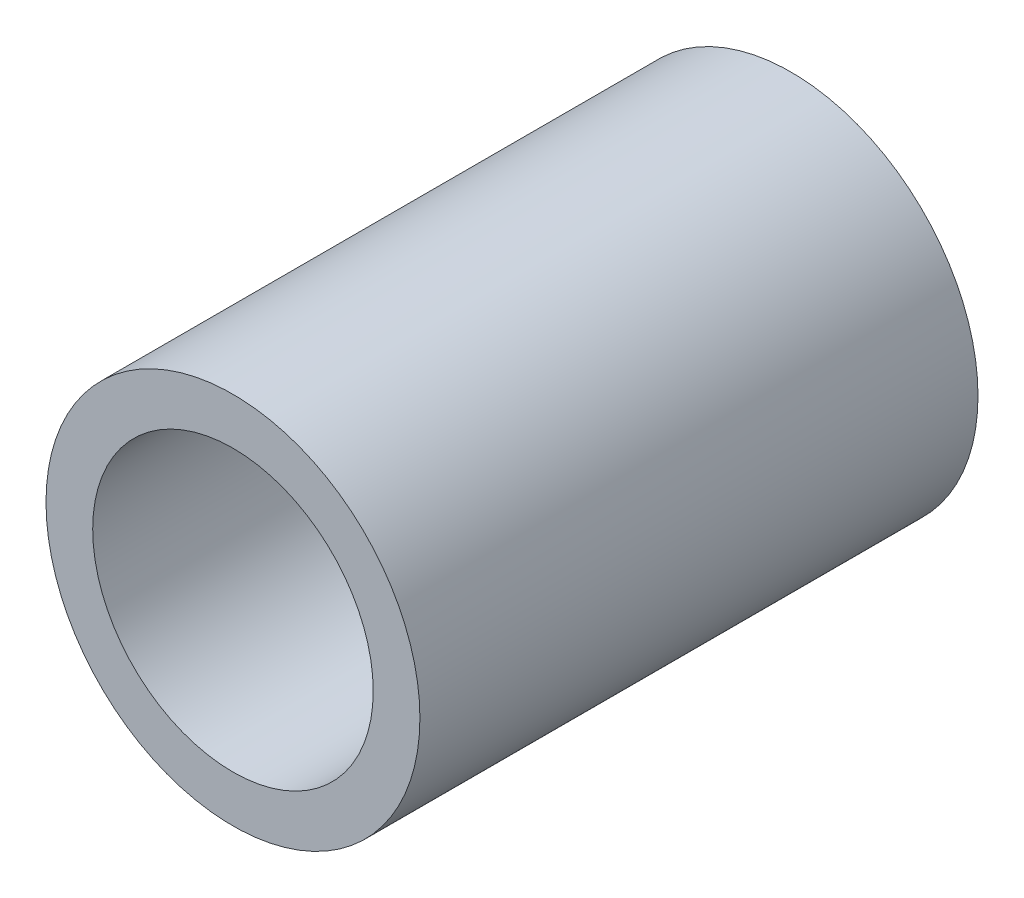
ISO-10303-21;
HEADER;
FILE_DESCRIPTION(('STEP AP214'),'2;1');
FILE_NAME('part.step','',(''),(''),'','','');
FILE_SCHEMA(('AUTOMOTIVE_DESIGN { 1 0 10303 214 1 1 1 1 }'));
ENDSEC;
DATA;
#1=APPLICATION_CONTEXT('core data for automotive mechanical design processes');
#2=APPLICATION_PROTOCOL_DEFINITION('international standard','automotive_design',2000,#1);
#3=PRODUCT_CONTEXT('',#1,'mechanical');
#4=PRODUCT('Part','Part','',(#3));
#5=PRODUCT_RELATED_PRODUCT_CATEGORY('part','',(#4));
#6=PRODUCT_DEFINITION_FORMATION('','',#4);
#7=PRODUCT_DEFINITION_CONTEXT('part definition',#1,'design');
#8=PRODUCT_DEFINITION('design','',#6,#7);
#9=PRODUCT_DEFINITION_SHAPE('','',#8);
#10=(LENGTH_UNIT() NAMED_UNIT(*) SI_UNIT(.MILLI.,.METRE.));
#11=(NAMED_UNIT(*) PLANE_ANGLE_UNIT() SI_UNIT($,.RADIAN.));
#12=(NAMED_UNIT(*) SI_UNIT($,.STERADIAN.) SOLID_ANGLE_UNIT());
#13=UNCERTAINTY_MEASURE_WITH_UNIT(LENGTH_MEASURE(1.E-05),#10,'distance_accuracy_value','');
#14=(GEOMETRIC_REPRESENTATION_CONTEXT(3) GLOBAL_UNCERTAINTY_ASSIGNED_CONTEXT((#13)) GLOBAL_UNIT_ASSIGNED_CONTEXT((#10,
#11,#12)) REPRESENTATION_CONTEXT('',''));
#15=CARTESIAN_POINT('',(0.,0.,0.));
#16=DIRECTION('',(0.,0.,1.));
#17=DIRECTION('',(1.,0.,0.));
#18=AXIS2_PLACEMENT_3D('',#15,#16,#17);
#19=CARTESIAN_POINT('',(0.,0.,-9.525));
#20=DIRECTION('',(0.,0.,1.));
#21=DIRECTION('',(1.,0.,0.));
#22=AXIS2_PLACEMENT_3D('',#19,#20,#21);
#23=CYLINDRICAL_SURFACE('',#22,6.38175);
#24=CARTESIAN_POINT('',(0.,0.,9.525));
#25=DIRECTION('',(0.,0.,1.));
#26=DIRECTION('',(1.,0.,0.));
#27=AXIS2_PLACEMENT_3D('',#24,#25,#26);
#28=CIRCLE('',#27,6.38175);
#29=CARTESIAN_POINT('',(6.38175,0.,9.525));
#30=VERTEX_POINT('',#29);
#31=EDGE_CURVE('E10',#30,#30,#28,.T.);
#32=ORIENTED_EDGE('',*,*,#31,.F.);
#33=EDGE_LOOP('',(#32));
#34=FACE_BOUND('',#33,.T.);
#35=CARTESIAN_POINT('',(0.,0.,-9.525));
#36=DIRECTION('',(0.,0.,1.));
#37=DIRECTION('',(1.,0.,0.));
#38=AXIS2_PLACEMENT_3D('',#35,#36,#37);
#39=CIRCLE('',#38,6.38175);
#40=CARTESIAN_POINT('',(6.38175,0.,-9.525));
#41=VERTEX_POINT('',#40);
#42=EDGE_CURVE('E46',#41,#41,#39,.T.);
#43=ORIENTED_EDGE('',*,*,#42,.T.);
#44=EDGE_LOOP('',(#43));
#45=FACE_BOUND('',#44,.T.);
#46=ADVANCED_FACE('F32',(#34,#45),#23,.T.);
#47=CARTESIAN_POINT('',(0.,6.38175,9.525));
#48=DIRECTION('',(0.,0.,-1.));
#49=DIRECTION('',(-1.,0.,0.));
#50=AXIS2_PLACEMENT_3D('',#47,#48,#49);
#51=PLANE('',#50);
#52=CARTESIAN_POINT('',(0.,0.,9.525));
#53=DIRECTION('',(0.,0.,1.));
#54=DIRECTION('',(1.,0.,0.));
#55=AXIS2_PLACEMENT_3D('',#52,#53,#54);
#56=CIRCLE('',#55,4.7879);
#57=CARTESIAN_POINT('',(4.7879,0.,9.525));
#58=VERTEX_POINT('',#57);
#59=EDGE_CURVE('E38',#58,#58,#56,.T.);
#60=ORIENTED_EDGE('',*,*,#59,.F.);
#61=EDGE_LOOP('',(#60));
#62=FACE_BOUND('',#61,.T.);
#63=ORIENTED_EDGE('',*,*,#31,.T.);
#64=EDGE_LOOP('',(#63));
#65=FACE_BOUND('',#64,.T.);
#66=ADVANCED_FACE('F61',(#62,#65),#51,.F.);
#67=CARTESIAN_POINT('',(0.,0.,-9.525));
#68=DIRECTION('',(0.,0.,1.));
#69=DIRECTION('',(1.,0.,0.));
#70=AXIS2_PLACEMENT_3D('',#67,#68,#69);
#71=CYLINDRICAL_SURFACE('',#70,4.7879);
#72=CARTESIAN_POINT('',(0.,0.,-9.525));
#73=DIRECTION('',(0.,0.,1.));
#74=DIRECTION('',(1.,0.,0.));
#75=AXIS2_PLACEMENT_3D('',#72,#73,#74);
#76=CIRCLE('',#75,4.7879);
#77=CARTESIAN_POINT('',(4.7879,0.,-9.525));
#78=VERTEX_POINT('',#77);
#79=EDGE_CURVE('E42',#78,#78,#76,.T.);
#80=ORIENTED_EDGE('',*,*,#79,.F.);
#81=EDGE_LOOP('',(#80));
#82=FACE_BOUND('',#81,.T.);
#83=ORIENTED_EDGE('',*,*,#59,.T.);
#84=EDGE_LOOP('',(#83));
#85=FACE_BOUND('',#84,.T.);
#86=ADVANCED_FACE('F56',(#82,#85),#71,.F.);
#87=CARTESIAN_POINT('',(0.,4.7879,-9.525));
#88=DIRECTION('',(0.,0.,1.));
#89=DIRECTION('',(1.,0.,0.));
#90=AXIS2_PLACEMENT_3D('',#87,#88,#89);
#91=PLANE('',#90);
#92=ORIENTED_EDGE('',*,*,#42,.F.);
#93=EDGE_LOOP('',(#92));
#94=FACE_BOUND('',#93,.T.);
#95=ORIENTED_EDGE('',*,*,#79,.T.);
#96=EDGE_LOOP('',(#95));
#97=FACE_BOUND('',#96,.T.);
#98=ADVANCED_FACE('F53',(#94,#97),#91,.F.);
#99=CLOSED_SHELL('',(#46,#66,#86,#98));
#100=MANIFOLD_SOLID_BREP('B2',#99);
#101=ADVANCED_BREP_SHAPE_REPRESENTATION('',(#18,#100),#14);
#102=SHAPE_DEFINITION_REPRESENTATION(#9,#101);
ENDSEC;
END-ISO-10303-21;
